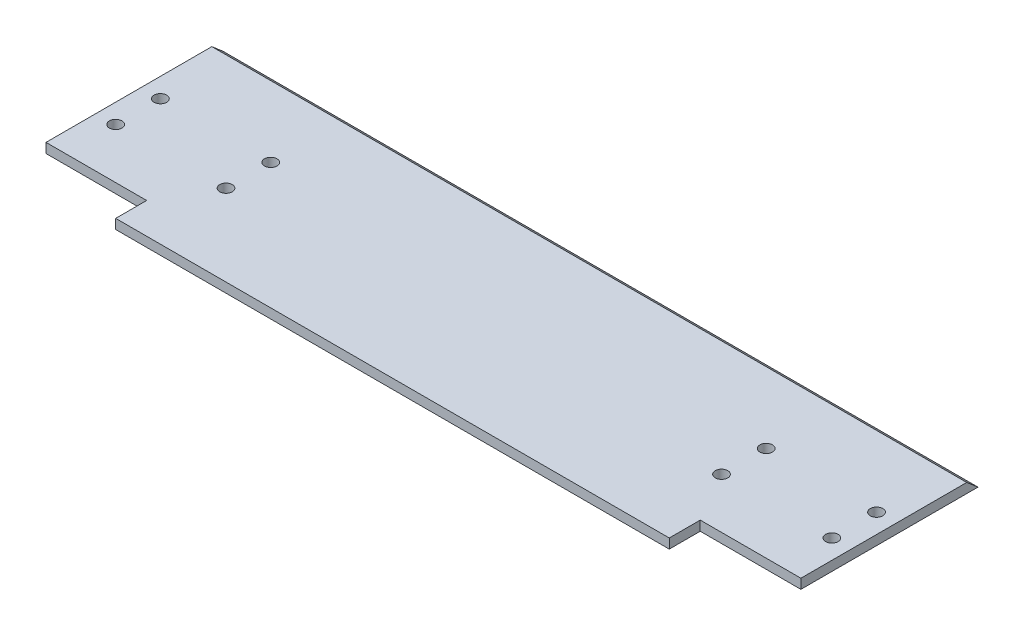
ISO-10303-21;
HEADER;
FILE_DESCRIPTION(('STEP AP214'),'2;1');
FILE_NAME('part.step','',(''),(''),'','','');
FILE_SCHEMA(('AUTOMOTIVE_DESIGN { 1 0 10303 214 1 1 1 1 }'));
ENDSEC;
DATA;
#1=APPLICATION_CONTEXT('core data for automotive mechanical design processes');
#2=APPLICATION_PROTOCOL_DEFINITION('international standard','automotive_design',2000,#1);
#3=PRODUCT_CONTEXT('',#1,'mechanical');
#4=PRODUCT('Part','Part','',(#3));
#5=PRODUCT_RELATED_PRODUCT_CATEGORY('part','',(#4));
#6=PRODUCT_DEFINITION_FORMATION('','',#4);
#7=PRODUCT_DEFINITION_CONTEXT('part definition',#1,'design');
#8=PRODUCT_DEFINITION('design','',#6,#7);
#9=PRODUCT_DEFINITION_SHAPE('','',#8);
#10=(LENGTH_UNIT() NAMED_UNIT(*) SI_UNIT(.MILLI.,.METRE.));
#11=(NAMED_UNIT(*) PLANE_ANGLE_UNIT() SI_UNIT($,.RADIAN.));
#12=(NAMED_UNIT(*) SI_UNIT($,.STERADIAN.) SOLID_ANGLE_UNIT());
#13=UNCERTAINTY_MEASURE_WITH_UNIT(LENGTH_MEASURE(1.E-05),#10,'distance_accuracy_value','');
#14=(GEOMETRIC_REPRESENTATION_CONTEXT(3) GLOBAL_UNCERTAINTY_ASSIGNED_CONTEXT((#13)) GLOBAL_UNIT_ASSIGNED_CONTEXT((#10,
#11,#12)) REPRESENTATION_CONTEXT('',''));
#15=CARTESIAN_POINT('',(0.,0.,0.));
#16=DIRECTION('',(0.,0.,1.));
#17=DIRECTION('',(1.,0.,0.));
#18=AXIS2_PLACEMENT_3D('',#15,#16,#17);
#19=CARTESIAN_POINT('',(-97.5,2.5,0.));
#20=DIRECTION('',(-1.,0.,0.));
#21=DIRECTION('',(0.,0.,1.));
#22=AXIS2_PLACEMENT_3D('',#19,#20,#21);
#23=PLANE('',#22);
#24=DIRECTION('',(0.,0.,-1.));
#25=VECTOR('',#24,1.);
#26=CARTESIAN_POINT('',(-97.5,0.,0.));
#27=LINE('',#26,#25);
#28=CARTESIAN_POINT('',(-97.5,0.,25.0000000000045));
#29=VERTEX_POINT('',#28);
#30=CARTESIAN_POINT('',(-97.5,0.,-20.7499999999954));
#31=VERTEX_POINT('',#30);
#32=EDGE_CURVE('E163',#29,#31,#27,.T.);
#33=ORIENTED_EDGE('',*,*,#32,.F.);
#34=DIRECTION('',(0.,-1.,0.));
#35=VECTOR('',#34,1.);
#36=CARTESIAN_POINT('',(-97.5,2.5,25.0000000000045));
#37=LINE('',#36,#35);
#38=CARTESIAN_POINT('',(-97.5,2.5,25.0000000000045));
#39=VERTEX_POINT('',#38);
#40=EDGE_CURVE('E46',#39,#29,#37,.T.);
#41=ORIENTED_EDGE('',*,*,#40,.F.);
#42=DIRECTION('',(0.,0.,-1.));
#43=VECTOR('',#42,1.);
#44=CARTESIAN_POINT('',(-97.5,2.5,0.));
#45=LINE('',#44,#43);
#46=CARTESIAN_POINT('',(-97.5,2.50000000000001,-17.8331999517203));
#47=VERTEX_POINT('',#46);
#48=EDGE_CURVE('E208',#39,#47,#45,.T.);
#49=ORIENTED_EDGE('',*,*,#48,.T.);
#50=DIRECTION('',(0.,0.650774217265846,0.759271307334885));
#51=VECTOR('',#50,1.);
#52=CARTESIAN_POINT('',(-97.5,2.5,-17.8331999517203));
#53=LINE('',#52,#51);
#54=EDGE_CURVE('E200',#31,#47,#53,.T.);
#55=ORIENTED_EDGE('',*,*,#54,.F.);
#56=EDGE_LOOP('',(#33,#41,#49,#55));
#57=FACE_BOUND('',#56,.T.);
#58=ADVANCED_FACE('F38',(#57),#23,.T.);
#59=CARTESIAN_POINT('',(0.,2.5,25.0000000000045));
#60=DIRECTION('',(0.,0.,1.));
#61=DIRECTION('',(1.,0.,0.));
#62=AXIS2_PLACEMENT_3D('',#59,#60,#61);
#63=PLANE('',#62);
#64=DIRECTION('',(-1.,0.,0.));
#65=VECTOR('',#64,1.);
#66=CARTESIAN_POINT('',(0.,0.,25.0000000000045));
#67=LINE('',#66,#65);
#68=CARTESIAN_POINT('',(-71.5,0.,25.0000000000045));
#69=VERTEX_POINT('',#68);
#70=EDGE_CURVE('E165',#69,#29,#67,.T.);
#71=ORIENTED_EDGE('',*,*,#70,.F.);
#72=DIRECTION('',(0.,-1.,0.));
#73=VECTOR('',#72,1.);
#74=CARTESIAN_POINT('',(-71.5,2.5,25.0000000000045));
#75=LINE('',#74,#73);
#76=CARTESIAN_POINT('',(-71.5,2.5,25.0000000000045));
#77=VERTEX_POINT('',#76);
#78=EDGE_CURVE('E191',#77,#69,#75,.T.);
#79=ORIENTED_EDGE('',*,*,#78,.F.);
#80=DIRECTION('',(-1.,0.,0.));
#81=VECTOR('',#80,1.);
#82=CARTESIAN_POINT('',(0.,2.5,25.0000000000045));
#83=LINE('',#82,#81);
#84=EDGE_CURVE('E132',#77,#39,#83,.T.);
#85=ORIENTED_EDGE('',*,*,#84,.T.);
#86=ORIENTED_EDGE('',*,*,#40,.T.);
#87=EDGE_LOOP('',(#71,#79,#85,#86));
#88=FACE_BOUND('',#87,.T.);
#89=ADVANCED_FACE('F196',(#88),#63,.T.);
#90=CARTESIAN_POINT('',(-71.5,2.5,0.));
#91=DIRECTION('',(-1.,0.,0.));
#92=DIRECTION('',(0.,0.,1.));
#93=AXIS2_PLACEMENT_3D('',#90,#91,#92);
#94=PLANE('',#93);
#95=DIRECTION('',(0.,1.,0.));
#96=VECTOR('',#95,1.);
#97=CARTESIAN_POINT('',(-71.5,-7.5,33.0000000000045));
#98=LINE('',#97,#96);
#99=CARTESIAN_POINT('',(-71.5,0.,33.0000000000045));
#100=VERTEX_POINT('',#99);
#101=CARTESIAN_POINT('',(-71.5,2.5,33.0000000000045));
#102=VERTEX_POINT('',#101);
#103=EDGE_CURVE('E53',#100,#102,#98,.T.);
#104=ORIENTED_EDGE('',*,*,#103,.T.);
#105=DIRECTION('',(0.,0.,-1.));
#106=VECTOR('',#105,1.);
#107=CARTESIAN_POINT('',(-71.5,2.5,0.));
#108=LINE('',#107,#106);
#109=EDGE_CURVE('E123',#102,#77,#108,.T.);
#110=ORIENTED_EDGE('',*,*,#109,.T.);
#111=ORIENTED_EDGE('',*,*,#78,.T.);
#112=DIRECTION('',(0.,0.,-1.));
#113=VECTOR('',#112,1.);
#114=CARTESIAN_POINT('',(-71.5,0.,0.));
#115=LINE('',#114,#113);
#116=EDGE_CURVE('E168',#100,#69,#115,.T.);
#117=ORIENTED_EDGE('',*,*,#116,.F.);
#118=EDGE_LOOP('',(#104,#110,#111,#117));
#119=FACE_BOUND('',#118,.T.);
#120=ADVANCED_FACE('F206',(#119),#94,.T.);
#121=CARTESIAN_POINT('',(71.5,2.5,0.));
#122=DIRECTION('',(-1.,0.,0.));
#123=DIRECTION('',(0.,0.,1.));
#124=AXIS2_PLACEMENT_3D('',#121,#122,#123);
#125=PLANE('',#124);
#126=DIRECTION('',(0.,0.,-1.));
#127=VECTOR('',#126,1.);
#128=CARTESIAN_POINT('',(71.5,2.5,0.));
#129=LINE('',#128,#127);
#130=CARTESIAN_POINT('',(71.5,2.5,33.0000000000045));
#131=VERTEX_POINT('',#130);
#132=CARTESIAN_POINT('',(71.5,2.5,25.0000000000045));
#133=VERTEX_POINT('',#132);
#134=EDGE_CURVE('E120',#131,#133,#129,.T.);
#135=ORIENTED_EDGE('',*,*,#134,.F.);
#136=DIRECTION('',(0.,1.,0.));
#137=VECTOR('',#136,1.);
#138=CARTESIAN_POINT('',(71.5,-7.5,33.0000000000045));
#139=LINE('',#138,#137);
#140=CARTESIAN_POINT('',(71.5,0.,33.0000000000045));
#141=VERTEX_POINT('',#140);
#142=EDGE_CURVE('E108',#141,#131,#139,.T.);
#143=ORIENTED_EDGE('',*,*,#142,.F.);
#144=DIRECTION('',(0.,0.,-1.));
#145=VECTOR('',#144,1.);
#146=CARTESIAN_POINT('',(71.5,0.,0.));
#147=LINE('',#146,#145);
#148=CARTESIAN_POINT('',(71.5,0.,25.0000000000045));
#149=VERTEX_POINT('',#148);
#150=EDGE_CURVE('E170',#141,#149,#147,.T.);
#151=ORIENTED_EDGE('',*,*,#150,.T.);
#152=DIRECTION('',(0.,-1.,0.));
#153=VECTOR('',#152,1.);
#154=CARTESIAN_POINT('',(71.5,2.5,25.0000000000045));
#155=LINE('',#154,#153);
#156=EDGE_CURVE('E128',#133,#149,#155,.T.);
#157=ORIENTED_EDGE('',*,*,#156,.F.);
#158=EDGE_LOOP('',(#135,#143,#151,#157));
#159=FACE_BOUND('',#158,.T.);
#160=ADVANCED_FACE('F126',(#159),#125,.F.);
#161=CARTESIAN_POINT('',(0.,2.5,25.0000000000045));
#162=DIRECTION('',(0.,0.,-1.));
#163=DIRECTION('',(-1.,0.,0.));
#164=AXIS2_PLACEMENT_3D('',#161,#162,#163);
#165=PLANE('',#164);
#166=DIRECTION('',(1.,0.,0.));
#167=VECTOR('',#166,1.);
#168=CARTESIAN_POINT('',(0.,0.,25.0000000000045));
#169=LINE('',#168,#167);
#170=CARTESIAN_POINT('',(97.5,0.,25.0000000000045));
#171=VERTEX_POINT('',#170);
#172=EDGE_CURVE('E172',#149,#171,#169,.T.);
#173=ORIENTED_EDGE('',*,*,#172,.T.);
#174=DIRECTION('',(0.,-1.,0.));
#175=VECTOR('',#174,1.);
#176=CARTESIAN_POINT('',(97.5,2.5,25.0000000000045));
#177=LINE('',#176,#175);
#178=CARTESIAN_POINT('',(97.5,2.5,25.0000000000045));
#179=VERTEX_POINT('',#178);
#180=EDGE_CURVE('E149',#179,#171,#177,.T.);
#181=ORIENTED_EDGE('',*,*,#180,.F.);
#182=DIRECTION('',(1.,0.,0.));
#183=VECTOR('',#182,1.);
#184=CARTESIAN_POINT('',(0.,2.5,25.0000000000045));
#185=LINE('',#184,#183);
#186=EDGE_CURVE('E129',#133,#179,#185,.T.);
#187=ORIENTED_EDGE('',*,*,#186,.F.);
#188=ORIENTED_EDGE('',*,*,#156,.T.);
#189=EDGE_LOOP('',(#173,#181,#187,#188));
#190=FACE_BOUND('',#189,.T.);
#191=ADVANCED_FACE('F235',(#190),#165,.F.);
#192=CARTESIAN_POINT('',(-92.5,2.5,0.460000000004493));
#193=DIRECTION('',(0.,-1.,0.));
#194=DIRECTION('',(0.,0.,-1.));
#195=AXIS2_PLACEMENT_3D('',#192,#193,#194);
#196=CYLINDRICAL_SURFACE('',#195,1.625);
#197=CARTESIAN_POINT('',(-92.5,2.5,0.460000000004493));
#198=DIRECTION('',(0.,1.,0.));
#199=DIRECTION('',(0.,0.,1.));
#200=AXIS2_PLACEMENT_3D('',#197,#198,#199);
#201=CIRCLE('',#200,1.625);
#202=CARTESIAN_POINT('',(-92.5,2.5,2.08500000000449));
#203=VERTEX_POINT('',#202);
#204=EDGE_CURVE('E143',#203,#203,#201,.F.);
#205=ORIENTED_EDGE('',*,*,#204,.F.);
#206=EDGE_LOOP('',(#205));
#207=FACE_BOUND('',#206,.T.);
#208=CARTESIAN_POINT('',(-92.5,0.,0.460000000004493));
#209=DIRECTION('',(0.,1.,0.));
#210=DIRECTION('',(0.,0.,1.));
#211=AXIS2_PLACEMENT_3D('',#208,#209,#210);
#212=CIRCLE('',#211,1.625);
#213=CARTESIAN_POINT('',(-92.5,0.,2.08500000000449));
#214=VERTEX_POINT('',#213);
#215=EDGE_CURVE('E182',#214,#214,#212,.F.);
#216=ORIENTED_EDGE('',*,*,#215,.T.);
#217=EDGE_LOOP('',(#216));
#218=FACE_BOUND('',#217,.T.);
#219=ADVANCED_FACE('F237',(#207,#218),#196,.F.);
#220=CARTESIAN_POINT('',(92.5,2.5,0.460000000004493));
#221=DIRECTION('',(0.,-1.,0.));
#222=DIRECTION('',(0.,0.,-1.));
#223=AXIS2_PLACEMENT_3D('',#220,#221,#222);
#224=CYLINDRICAL_SURFACE('',#223,1.625);
#225=CARTESIAN_POINT('',(92.5,2.5,0.460000000004493));
#226=DIRECTION('',(0.,1.,0.));
#227=DIRECTION('',(0.,0.,1.));
#228=AXIS2_PLACEMENT_3D('',#225,#226,#227);
#229=CIRCLE('',#228,1.625);
#230=CARTESIAN_POINT('',(92.5,2.5,2.08500000000449));
#231=VERTEX_POINT('',#230);
#232=EDGE_CURVE('E140',#231,#231,#229,.T.);
#233=ORIENTED_EDGE('',*,*,#232,.T.);
#234=EDGE_LOOP('',(#233));
#235=FACE_BOUND('',#234,.T.);
#236=CARTESIAN_POINT('',(92.5,0.,0.460000000004493));
#237=DIRECTION('',(0.,1.,0.));
#238=DIRECTION('',(0.,0.,1.));
#239=AXIS2_PLACEMENT_3D('',#236,#237,#238);
#240=CIRCLE('',#239,1.625);
#241=CARTESIAN_POINT('',(92.5,0.,2.08500000000449));
#242=VERTEX_POINT('',#241);
#243=EDGE_CURVE('E179',#242,#242,#240,.T.);
#244=ORIENTED_EDGE('',*,*,#243,.F.);
#245=EDGE_LOOP('',(#244));
#246=FACE_BOUND('',#245,.T.);
#247=ADVANCED_FACE('F243',(#235,#246),#224,.F.);
#248=CARTESIAN_POINT('',(64.,2.5,0.460000000004493));
#249=DIRECTION('',(0.,-1.,0.));
#250=DIRECTION('',(0.,0.,-1.));
#251=AXIS2_PLACEMENT_3D('',#248,#249,#250);
#252=CYLINDRICAL_SURFACE('',#251,1.625);
#253=CARTESIAN_POINT('',(64.,2.5,0.460000000004493));
#254=DIRECTION('',(0.,1.,0.));
#255=DIRECTION('',(0.,0.,1.));
#256=AXIS2_PLACEMENT_3D('',#253,#254,#255);
#257=CIRCLE('',#256,1.625);
#258=CARTESIAN_POINT('',(64.,2.5,2.08500000000449));
#259=VERTEX_POINT('',#258);
#260=EDGE_CURVE('E137',#259,#259,#257,.T.);
#261=ORIENTED_EDGE('',*,*,#260,.T.);
#262=EDGE_LOOP('',(#261));
#263=FACE_BOUND('',#262,.T.);
#264=CARTESIAN_POINT('',(64.,0.,0.460000000004493));
#265=DIRECTION('',(0.,1.,0.));
#266=DIRECTION('',(0.,0.,1.));
#267=AXIS2_PLACEMENT_3D('',#264,#265,#266);
#268=CIRCLE('',#267,1.625);
#269=CARTESIAN_POINT('',(64.,0.,2.08500000000449));
#270=VERTEX_POINT('',#269);
#271=EDGE_CURVE('E176',#270,#270,#268,.T.);
#272=ORIENTED_EDGE('',*,*,#271,.F.);
#273=EDGE_LOOP('',(#272));
#274=FACE_BOUND('',#273,.T.);
#275=ADVANCED_FACE('F297',(#263,#274),#252,.F.);
#276=CARTESIAN_POINT('',(97.5,2.5,0.));
#277=DIRECTION('',(-1.,0.,0.));
#278=DIRECTION('',(0.,0.,1.));
#279=AXIS2_PLACEMENT_3D('',#276,#277,#278);
#280=PLANE('',#279);
#281=DIRECTION('',(0.,0.,-1.));
#282=VECTOR('',#281,1.);
#283=CARTESIAN_POINT('',(97.5,0.,0.));
#284=LINE('',#283,#282);
#285=CARTESIAN_POINT('',(97.5,0.,-20.7499999999955));
#286=VERTEX_POINT('',#285);
#287=EDGE_CURVE('E84',#171,#286,#284,.T.);
#288=ORIENTED_EDGE('',*,*,#287,.T.);
#289=DIRECTION('',(0.,0.650774217265847,0.759271307334885));
#290=VECTOR('',#289,1.);
#291=CARTESIAN_POINT('',(97.5,2.5,-17.8331999517204));
#292=LINE('',#291,#290);
#293=CARTESIAN_POINT('',(97.5,2.5,-17.8331999517204));
#294=VERTEX_POINT('',#293);
#295=EDGE_CURVE('E224',#286,#294,#292,.T.);
#296=ORIENTED_EDGE('',*,*,#295,.T.);
#297=DIRECTION('',(0.,0.,-1.));
#298=VECTOR('',#297,1.);
#299=CARTESIAN_POINT('',(97.5,2.5,0.));
#300=LINE('',#299,#298);
#301=EDGE_CURVE('E61',#179,#294,#300,.T.);
#302=ORIENTED_EDGE('',*,*,#301,.F.);
#303=ORIENTED_EDGE('',*,*,#180,.T.);
#304=EDGE_LOOP('',(#288,#296,#302,#303));
#305=FACE_BOUND('',#304,.T.);
#306=ADVANCED_FACE('F230',(#305),#280,.F.);
#307=CARTESIAN_POINT('',(64.,2.5,12.0000000000045));
#308=DIRECTION('',(0.,-1.,0.));
#309=DIRECTION('',(0.,0.,-1.));
#310=AXIS2_PLACEMENT_3D('',#307,#308,#309);
#311=CYLINDRICAL_SURFACE('',#310,1.625);
#312=CARTESIAN_POINT('',(64.,2.5,12.0000000000045));
#313=DIRECTION('',(0.,1.,0.));
#314=DIRECTION('',(0.,0.,1.));
#315=AXIS2_PLACEMENT_3D('',#312,#313,#314);
#316=CIRCLE('',#315,1.625);
#317=CARTESIAN_POINT('',(64.,2.5,13.6250000000045));
#318=VERTEX_POINT('',#317);
#319=EDGE_CURVE('E209',#318,#318,#316,.T.);
#320=ORIENTED_EDGE('',*,*,#319,.T.);
#321=EDGE_LOOP('',(#320));
#322=FACE_BOUND('',#321,.T.);
#323=CARTESIAN_POINT('',(64.,0.,12.0000000000045));
#324=DIRECTION('',(0.,1.,0.));
#325=DIRECTION('',(0.,0.,1.));
#326=AXIS2_PLACEMENT_3D('',#323,#324,#325);
#327=CIRCLE('',#326,1.625);
#328=CARTESIAN_POINT('',(64.,0.,13.6250000000045));
#329=VERTEX_POINT('',#328);
#330=EDGE_CURVE('E160',#329,#329,#327,.T.);
#331=ORIENTED_EDGE('',*,*,#330,.F.);
#332=EDGE_LOOP('',(#331));
#333=FACE_BOUND('',#332,.T.);
#334=ADVANCED_FACE('F256',(#322,#333),#311,.F.);
#335=CARTESIAN_POINT('',(92.5,2.5,12.0000000000045));
#336=DIRECTION('',(0.,-1.,0.));
#337=DIRECTION('',(0.,0.,-1.));
#338=AXIS2_PLACEMENT_3D('',#335,#336,#337);
#339=CYLINDRICAL_SURFACE('',#338,1.625);
#340=CARTESIAN_POINT('',(92.5,2.5,12.0000000000045));
#341=DIRECTION('',(0.,1.,0.));
#342=DIRECTION('',(0.,0.,1.));
#343=AXIS2_PLACEMENT_3D('',#340,#341,#342);
#344=CIRCLE('',#343,1.625);
#345=CARTESIAN_POINT('',(92.5,2.5,13.6250000000045));
#346=VERTEX_POINT('',#345);
#347=EDGE_CURVE('E214',#346,#346,#344,.T.);
#348=ORIENTED_EDGE('',*,*,#347,.T.);
#349=EDGE_LOOP('',(#348));
#350=FACE_BOUND('',#349,.T.);
#351=CARTESIAN_POINT('',(92.5,0.,12.0000000000045));
#352=DIRECTION('',(0.,1.,0.));
#353=DIRECTION('',(0.,0.,1.));
#354=AXIS2_PLACEMENT_3D('',#351,#352,#353);
#355=CIRCLE('',#354,1.625);
#356=CARTESIAN_POINT('',(92.5,0.,13.6250000000045));
#357=VERTEX_POINT('',#356);
#358=EDGE_CURVE('E157',#357,#357,#355,.T.);
#359=ORIENTED_EDGE('',*,*,#358,.F.);
#360=EDGE_LOOP('',(#359));
#361=FACE_BOUND('',#360,.T.);
#362=ADVANCED_FACE('F259',(#350,#361),#339,.F.);
#363=CARTESIAN_POINT('',(-92.5,2.5,12.0000000000045));
#364=DIRECTION('',(0.,-1.,0.));
#365=DIRECTION('',(0.,0.,-1.));
#366=AXIS2_PLACEMENT_3D('',#363,#364,#365);
#367=CYLINDRICAL_SURFACE('',#366,1.625);
#368=CARTESIAN_POINT('',(-92.5,2.5,12.0000000000045));
#369=DIRECTION('',(0.,1.,0.));
#370=DIRECTION('',(0.,0.,1.));
#371=AXIS2_PLACEMENT_3D('',#368,#369,#370);
#372=CIRCLE('',#371,1.625);
#373=CARTESIAN_POINT('',(-92.5,2.5,13.6250000000045));
#374=VERTEX_POINT('',#373);
#375=EDGE_CURVE('E217',#374,#374,#372,.F.);
#376=ORIENTED_EDGE('',*,*,#375,.F.);
#377=EDGE_LOOP('',(#376));
#378=FACE_BOUND('',#377,.T.);
#379=CARTESIAN_POINT('',(-92.5,0.,12.0000000000045));
#380=DIRECTION('',(0.,1.,0.));
#381=DIRECTION('',(0.,0.,1.));
#382=AXIS2_PLACEMENT_3D('',#379,#380,#381);
#383=CIRCLE('',#382,1.625);
#384=CARTESIAN_POINT('',(-92.5,0.,13.6250000000045));
#385=VERTEX_POINT('',#384);
#386=EDGE_CURVE('E153',#385,#385,#383,.F.);
#387=ORIENTED_EDGE('',*,*,#386,.T.);
#388=EDGE_LOOP('',(#387));
#389=FACE_BOUND('',#388,.T.);
#390=ADVANCED_FACE('F262',(#378,#389),#367,.F.);
#391=CARTESIAN_POINT('',(-64.,2.5,0.460000000004493));
#392=DIRECTION('',(0.,-1.,0.));
#393=DIRECTION('',(0.,0.,-1.));
#394=AXIS2_PLACEMENT_3D('',#391,#392,#393);
#395=CYLINDRICAL_SURFACE('',#394,1.625);
#396=CARTESIAN_POINT('',(-64.,2.5,0.460000000004493));
#397=DIRECTION('',(0.,1.,0.));
#398=DIRECTION('',(0.,0.,1.));
#399=AXIS2_PLACEMENT_3D('',#396,#397,#398);
#400=CIRCLE('',#399,1.625);
#401=CARTESIAN_POINT('',(-64.,2.5,2.08500000000449));
#402=VERTEX_POINT('',#401);
#403=EDGE_CURVE('E188',#402,#402,#400,.F.);
#404=ORIENTED_EDGE('',*,*,#403,.F.);
#405=EDGE_LOOP('',(#404));
#406=FACE_BOUND('',#405,.T.);
#407=CARTESIAN_POINT('',(-64.,0.,0.460000000004493));
#408=DIRECTION('',(0.,1.,0.));
#409=DIRECTION('',(0.,0.,1.));
#410=AXIS2_PLACEMENT_3D('',#407,#408,#409);
#411=CIRCLE('',#410,1.625);
#412=CARTESIAN_POINT('',(-64.,0.,2.08500000000449));
#413=VERTEX_POINT('',#412);
#414=EDGE_CURVE('E150',#413,#413,#411,.F.);
#415=ORIENTED_EDGE('',*,*,#414,.T.);
#416=EDGE_LOOP('',(#415));
#417=FACE_BOUND('',#416,.T.);
#418=ADVANCED_FACE('F40',(#406,#417),#395,.F.);
#419=CARTESIAN_POINT('',(-64.,2.5,12.0000000000045));
#420=DIRECTION('',(0.,-1.,0.));
#421=DIRECTION('',(0.,0.,-1.));
#422=AXIS2_PLACEMENT_3D('',#419,#420,#421);
#423=CYLINDRICAL_SURFACE('',#422,1.625);
#424=CARTESIAN_POINT('',(-64.,2.5,12.0000000000045));
#425=DIRECTION('',(0.,1.,0.));
#426=DIRECTION('',(0.,0.,1.));
#427=AXIS2_PLACEMENT_3D('',#424,#425,#426);
#428=CIRCLE('',#427,1.625);
#429=CARTESIAN_POINT('',(-64.,2.5,13.6250000000045));
#430=VERTEX_POINT('',#429);
#431=EDGE_CURVE('E146',#430,#430,#428,.F.);
#432=ORIENTED_EDGE('',*,*,#431,.F.);
#433=EDGE_LOOP('',(#432));
#434=FACE_BOUND('',#433,.T.);
#435=CARTESIAN_POINT('',(-64.,0.,12.0000000000045));
#436=DIRECTION('',(0.,1.,0.));
#437=DIRECTION('',(0.,0.,1.));
#438=AXIS2_PLACEMENT_3D('',#435,#436,#437);
#439=CIRCLE('',#438,1.625);
#440=CARTESIAN_POINT('',(-64.,0.,13.6250000000045));
#441=VERTEX_POINT('',#440);
#442=EDGE_CURVE('E185',#441,#441,#439,.F.);
#443=ORIENTED_EDGE('',*,*,#442,.T.);
#444=EDGE_LOOP('',(#443));
#445=FACE_BOUND('',#444,.T.);
#446=ADVANCED_FACE('F269',(#434,#445),#423,.F.);
#447=CARTESIAN_POINT('',(0.,2.5,0.));
#448=DIRECTION('',(0.,1.,0.));
#449=DIRECTION('',(0.,0.,1.));
#450=AXIS2_PLACEMENT_3D('',#447,#448,#449);
#451=PLANE('',#450);
#452=DIRECTION('',(-1.,0.,0.));
#453=VECTOR('',#452,1.);
#454=CARTESIAN_POINT('',(-71.5,2.5,33.0000000000045));
#455=LINE('',#454,#453);
#456=EDGE_CURVE('E111',#131,#102,#455,.T.);
#457=ORIENTED_EDGE('',*,*,#456,.F.);
#458=ORIENTED_EDGE('',*,*,#134,.T.);
#459=ORIENTED_EDGE('',*,*,#186,.T.);
#460=ORIENTED_EDGE('',*,*,#301,.T.);
#461=DIRECTION('',(1.,0.,0.));
#462=VECTOR('',#461,1.);
#463=CARTESIAN_POINT('',(-112.756228236363,2.5,-17.8331999517203));
#464=LINE('',#463,#462);
#465=EDGE_CURVE('E154',#47,#294,#464,.T.);
#466=ORIENTED_EDGE('',*,*,#465,.F.);
#467=ORIENTED_EDGE('',*,*,#48,.F.);
#468=ORIENTED_EDGE('',*,*,#84,.F.);
#469=ORIENTED_EDGE('',*,*,#109,.F.);
#470=EDGE_LOOP('',(#457,#458,#459,#460,#466,#467,#468,#469));
#471=FACE_BOUND('',#470,.T.);
#472=ORIENTED_EDGE('',*,*,#403,.T.);
#473=EDGE_LOOP('',(#472));
#474=FACE_BOUND('',#473,.T.);
#475=ORIENTED_EDGE('',*,*,#375,.T.);
#476=EDGE_LOOP('',(#475));
#477=FACE_BOUND('',#476,.T.);
#478=ORIENTED_EDGE('',*,*,#347,.F.);
#479=EDGE_LOOP('',(#478));
#480=FACE_BOUND('',#479,.T.);
#481=ORIENTED_EDGE('',*,*,#319,.F.);
#482=EDGE_LOOP('',(#481));
#483=FACE_BOUND('',#482,.T.);
#484=ORIENTED_EDGE('',*,*,#260,.F.);
#485=EDGE_LOOP('',(#484));
#486=FACE_BOUND('',#485,.T.);
#487=ORIENTED_EDGE('',*,*,#232,.F.);
#488=EDGE_LOOP('',(#487));
#489=FACE_BOUND('',#488,.T.);
#490=ORIENTED_EDGE('',*,*,#204,.T.);
#491=EDGE_LOOP('',(#490));
#492=FACE_BOUND('',#491,.T.);
#493=ORIENTED_EDGE('',*,*,#431,.T.);
#494=EDGE_LOOP('',(#493));
#495=FACE_BOUND('',#494,.T.);
#496=ADVANCED_FACE('F118',(#471,#474,#477,#480,#483,#486,#489,#492,#495),#451,.T.);
#497=CARTESIAN_POINT('',(0.,0.,0.));
#498=DIRECTION('',(0.,1.,0.));
#499=DIRECTION('',(0.,0.,1.));
#500=AXIS2_PLACEMENT_3D('',#497,#498,#499);
#501=PLANE('',#500);
#502=ORIENTED_EDGE('',*,*,#414,.F.);
#503=EDGE_LOOP('',(#502));
#504=FACE_BOUND('',#503,.T.);
#505=ORIENTED_EDGE('',*,*,#386,.F.);
#506=EDGE_LOOP('',(#505));
#507=FACE_BOUND('',#506,.T.);
#508=ORIENTED_EDGE('',*,*,#358,.T.);
#509=EDGE_LOOP('',(#508));
#510=FACE_BOUND('',#509,.T.);
#511=ORIENTED_EDGE('',*,*,#330,.T.);
#512=EDGE_LOOP('',(#511));
#513=FACE_BOUND('',#512,.T.);
#514=ORIENTED_EDGE('',*,*,#150,.F.);
#515=DIRECTION('',(-1.,0.,0.));
#516=VECTOR('',#515,1.);
#517=CARTESIAN_POINT('',(0.,0.,33.0000000000045));
#518=LINE('',#517,#516);
#519=EDGE_CURVE('E11',#141,#100,#518,.T.);
#520=ORIENTED_EDGE('',*,*,#519,.T.);
#521=ORIENTED_EDGE('',*,*,#116,.T.);
#522=ORIENTED_EDGE('',*,*,#70,.T.);
#523=ORIENTED_EDGE('',*,*,#32,.T.);
#524=DIRECTION('',(1.,0.,0.));
#525=VECTOR('',#524,1.);
#526=CARTESIAN_POINT('',(-112.756228236363,0.,-20.7499999999954));
#527=LINE('',#526,#525);
#528=EDGE_CURVE('E222',#31,#286,#527,.T.);
#529=ORIENTED_EDGE('',*,*,#528,.T.);
#530=ORIENTED_EDGE('',*,*,#287,.F.);
#531=ORIENTED_EDGE('',*,*,#172,.F.);
#532=EDGE_LOOP('',(#514,#520,#521,#522,#523,#529,#530,#531));
#533=FACE_BOUND('',#532,.T.);
#534=ORIENTED_EDGE('',*,*,#271,.T.);
#535=EDGE_LOOP('',(#534));
#536=FACE_BOUND('',#535,.T.);
#537=ORIENTED_EDGE('',*,*,#243,.T.);
#538=EDGE_LOOP('',(#537));
#539=FACE_BOUND('',#538,.T.);
#540=ORIENTED_EDGE('',*,*,#215,.F.);
#541=EDGE_LOOP('',(#540));
#542=FACE_BOUND('',#541,.T.);
#543=ORIENTED_EDGE('',*,*,#442,.F.);
#544=EDGE_LOOP('',(#543));
#545=FACE_BOUND('',#544,.T.);
#546=ADVANCED_FACE('F202',(#504,#507,#510,#513,#533,#536,#539,#542,#545),#501,.F.);
#547=CARTESIAN_POINT('',(-112.756228236363,2.5,-17.8331999517203));
#548=DIRECTION('',(0.,0.759271307334885,-0.650774217265846));
#549=DIRECTION('',(0.,0.650774217265846,0.759271307334885));
#550=AXIS2_PLACEMENT_3D('',#547,#548,#549);
#551=PLANE('',#550);
#552=ORIENTED_EDGE('',*,*,#528,.F.);
#553=ORIENTED_EDGE('',*,*,#54,.T.);
#554=ORIENTED_EDGE('',*,*,#465,.T.);
#555=ORIENTED_EDGE('',*,*,#295,.F.);
#556=EDGE_LOOP('',(#552,#553,#554,#555));
#557=FACE_BOUND('',#556,.T.);
#558=ADVANCED_FACE('F232',(#557),#551,.T.);
#559=CARTESIAN_POINT('',(-71.5,-7.5,33.0000000000045));
#560=DIRECTION('',(0.,0.,-1.));
#561=DIRECTION('',(-1.,0.,0.));
#562=AXIS2_PLACEMENT_3D('',#559,#560,#561);
#563=PLANE('',#562);
#564=ORIENTED_EDGE('',*,*,#142,.T.);
#565=ORIENTED_EDGE('',*,*,#456,.T.);
#566=ORIENTED_EDGE('',*,*,#103,.F.);
#567=ORIENTED_EDGE('',*,*,#519,.F.);
#568=EDGE_LOOP('',(#564,#565,#566,#567));
#569=FACE_BOUND('',#568,.T.);
#570=ADVANCED_FACE('F110',(#569),#563,.F.);
#571=CLOSED_SHELL('',(#58,#89,#120,#160,#191,#219,#247,#275,#306,#334,#362,#390,#418,#446,#496,
#546,#558,#570));
#572=MANIFOLD_SOLID_BREP('B2',#571);
#573=ADVANCED_BREP_SHAPE_REPRESENTATION('',(#18,#572),#14);
#574=SHAPE_DEFINITION_REPRESENTATION(#9,#573);
ENDSEC;
END-ISO-10303-21;
